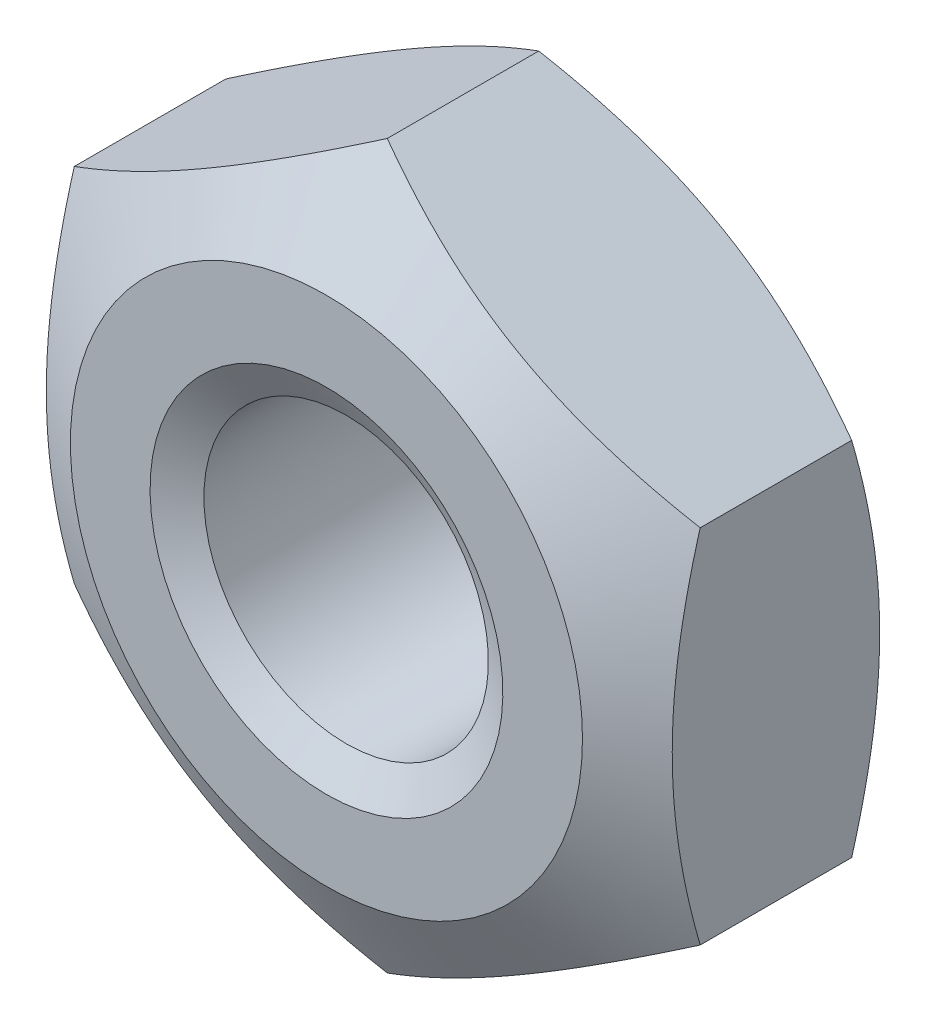
ISO-10303-21;
HEADER;
FILE_DESCRIPTION(('STEP AP214'),'2;1');
FILE_NAME('part.step','',(''),(''),'','','');
FILE_SCHEMA(('AUTOMOTIVE_DESIGN { 1 0 10303 214 1 1 1 1 }'));
ENDSEC;
DATA;
#1=APPLICATION_CONTEXT('core data for automotive mechanical design processes');
#2=APPLICATION_PROTOCOL_DEFINITION('international standard','automotive_design',2000,#1);
#3=PRODUCT_CONTEXT('',#1,'mechanical');
#4=PRODUCT('Part','Part','',(#3));
#5=PRODUCT_RELATED_PRODUCT_CATEGORY('part','',(#4));
#6=PRODUCT_DEFINITION_FORMATION('','',#4);
#7=PRODUCT_DEFINITION_CONTEXT('part definition',#1,'design');
#8=PRODUCT_DEFINITION('design','',#6,#7);
#9=PRODUCT_DEFINITION_SHAPE('','',#8);
#10=(LENGTH_UNIT() NAMED_UNIT(*) SI_UNIT(.MILLI.,.METRE.));
#11=(NAMED_UNIT(*) PLANE_ANGLE_UNIT() SI_UNIT($,.RADIAN.));
#12=(NAMED_UNIT(*) SI_UNIT($,.STERADIAN.) SOLID_ANGLE_UNIT());
#13=UNCERTAINTY_MEASURE_WITH_UNIT(LENGTH_MEASURE(1.E-05),#10,'distance_accuracy_value','');
#14=(GEOMETRIC_REPRESENTATION_CONTEXT(3) GLOBAL_UNCERTAINTY_ASSIGNED_CONTEXT((#13)) GLOBAL_UNIT_ASSIGNED_CONTEXT((#10,
#11,#12)) REPRESENTATION_CONTEXT('',''));
#15=CARTESIAN_POINT('',(0.,0.,0.));
#16=DIRECTION('',(0.,0.,1.));
#17=DIRECTION('',(1.,0.,0.));
#18=AXIS2_PLACEMENT_3D('',#15,#16,#17);
#19=CARTESIAN_POINT('',(0.,0.,0.));
#20=DIRECTION('',(0.,0.,1.));
#21=DIRECTION('',(1.,0.,0.));
#22=AXIS2_PLACEMENT_3D('',#19,#20,#21);
#23=PLANE('',#22);
#24=CARTESIAN_POINT('',(0.,0.,0.));
#25=DIRECTION('',(0.,0.,1.));
#26=DIRECTION('',(0.,-1.,0.));
#27=AXIS2_PLACEMENT_3D('',#24,#25,#26);
#28=CIRCLE('',#27,1.55);
#29=CARTESIAN_POINT('',(0.,-1.54999999999999,0.));
#30=VERTEX_POINT('',#29);
#31=EDGE_CURVE('E265',#30,#30,#28,.T.);
#32=ORIENTED_EDGE('',*,*,#31,.F.);
#33=EDGE_LOOP('',(#32));
#34=FACE_BOUND('',#33,.T.);
#35=CARTESIAN_POINT('',(0.,0.,0.));
#36=DIRECTION('',(0.,0.,1.));
#37=DIRECTION('',(1.,0.,0.));
#38=AXIS2_PLACEMENT_3D('',#35,#36,#37);
#39=CIRCLE('',#38,2.25);
#40=CARTESIAN_POINT('',(2.25,0.,0.));
#41=VERTEX_POINT('',#40);
#42=EDGE_CURVE('E224',#41,#41,#39,.T.);
#43=ORIENTED_EDGE('',*,*,#42,.T.);
#44=EDGE_LOOP('',(#43));
#45=FACE_BOUND('',#44,.T.);
#46=ADVANCED_FACE('F37',(#34,#45),#23,.T.);
#47=CARTESIAN_POINT('',(0.,0.,0.));
#48=DIRECTION('',(0.,0.,-1.));
#49=DIRECTION('',(-1.,0.,0.));
#50=AXIS2_PLACEMENT_3D('',#47,#48,#49);
#51=CONICAL_SURFACE('',#50,2.25,1.0471975511966);
#52=CARTESIAN_POINT('',(-2.75020000000001,1.58759777021761,-0.534361897959571));
#53=CARTESIAN_POINT('',(-2.6293507793401,1.65737010029696,-0.494062796844074));
#54=CARTESIAN_POINT('',(-2.50745839737738,1.72774469983531,-0.457412037192472));
#55=CARTESIAN_POINT('',(-2.26156287327212,1.86971254687,-0.39343731756461));
#56=CARTESIAN_POINT('',(-2.13755536142616,1.94130831721581,-0.366135990269306));
#57=CARTESIAN_POINT('',(-1.89107720202407,2.08361254889597,-0.323636879888924));
#58=CARTESIAN_POINT('',(-1.7686444814126,2.15429911309862,-0.308156253217264));
#59=CARTESIAN_POINT('',(-1.5232028576311,2.29600490065921,-0.289674531964746));
#60=CARTESIAN_POINT('',(-1.4001948467671,2.36702360884402,-0.286658134057405));
#61=CARTESIAN_POINT('',(-1.17034121338922,2.49972966594895,-0.292928280023351));
#62=CARTESIAN_POINT('',(-1.06346120874599,2.56143686540071,-0.300675288871507));
#63=CARTESIAN_POINT('',(-0.85039753266526,2.68444923614045,-0.325230315659159));
#64=CARTESIAN_POINT('',(-0.744214598351119,2.74575398185006,-0.342046724245375));
#65=CARTESIAN_POINT('',(-0.530711510606822,2.86902004703205,-0.384087056940762));
#66=CARTESIAN_POINT('',(-0.42341838385715,2.93096576264317,-0.409489215282037));
#67=CARTESIAN_POINT('',(-0.210432520715951,3.05393320806133,-0.467142360434789));
#68=CARTESIAN_POINT('',(-0.104737054973348,3.11495651365994,-0.49937979789379));
#69=CARTESIAN_POINT('',(0.000199999999999974,3.17554195059677,-0.534361897959569));
#70=B_SPLINE_CURVE_WITH_KNOTS('',3,(#52,#53,#54,#55,#56,#57,#58,#59,#60,#61,#62,#63,#64,#65,#66,
#67,#68,#69),.UNSPECIFIED.,.F.,.F.,(4,2,2,2,2,2,2,2,4),(0.,0.435912828725888,0.872873557116332,
1.29901931904671,1.72464171213573,2.09526089052938,2.46622354066375,2.84541551798559,
3.22386274754526),.UNSPECIFIED.);
#71=CARTESIAN_POINT('',(-2.75,1.58771324027145,-0.534295227656671));
#72=VERTEX_POINT('',#71);
#73=CARTESIAN_POINT('',(0.,3.17542648054293,-0.534295227656671));
#74=VERTEX_POINT('',#73);
#75=EDGE_CURVE('E219',#72,#74,#70,.T.);
#76=ORIENTED_EDGE('',*,*,#75,.F.);
#77=CARTESIAN_POINT('',(-2.74999999999998,-4.17094191172018,-1.58535995000983));
#78=CARTESIAN_POINT('',(-2.74999999999998,-4.05157417919455,-1.52783985485414));
#79=CARTESIAN_POINT('',(-2.74999999999999,-3.93192208680263,-1.47089921340537));
#80=CARTESIAN_POINT('',(-2.74999999999999,-3.69189754974667,-1.35850483223983));
#81=CARTESIAN_POINT('',(-2.74999999999999,-3.57152498585856,-1.30305134743429));
#82=CARTESIAN_POINT('',(-2.74999999999999,-3.3292414178549,-1.19365987345141));
#83=CARTESIAN_POINT('',(-2.74999999999999,-3.20732553286572,-1.1397326551652));
#84=CARTESIAN_POINT('',(-2.74999999999999,-2.96249043886675,-1.03421478265883));
#85=CARTESIAN_POINT('',(-2.74999999999999,-2.83957128062765,-0.982624011057358));
#86=CARTESIAN_POINT('',(-2.74999999999999,-2.58897064424779,-0.880953460848801));
#87=CARTESIAN_POINT('',(-2.74999999999999,-2.46125395597333,-0.830959972131938));
#88=CARTESIAN_POINT('',(-2.74999999999999,-2.20429217508488,-0.734989140643749));
#89=CARTESIAN_POINT('',(-2.74999999999999,-2.0750469081031,-0.689012261170476));
#90=CARTESIAN_POINT('',(-2.74999999999999,-1.81509622614656,-0.602350799198662));
#91=CARTESIAN_POINT('',(-2.75,-1.68439471248182,-0.561654637381358));
#92=CARTESIAN_POINT('',(-2.75,-1.42112044045795,-0.486921696520409));
#93=CARTESIAN_POINT('',(-2.75,-1.28854831568341,-0.452882718076814));
#94=CARTESIAN_POINT('',(-2.75,-1.02216222796121,-0.393330190707876));
#95=CARTESIAN_POINT('',(-2.75,-0.888357777462689,-0.367774900827353));
#96=CARTESIAN_POINT('',(-2.75,-0.619188443271271,-0.326700866431593));
#97=CARTESIAN_POINT('',(-2.75,-0.483823678897038,-0.311181359585503));
#98=CARTESIAN_POINT('',(-2.75,-0.213936143558709,-0.291620721702803));
#99=CARTESIAN_POINT('',(-2.75,-0.0794237789789004,-0.287439497799149));
#100=CARTESIAN_POINT('',(-2.75,0.189476875095198,-0.290546406339069));
#101=CARTESIAN_POINT('',(-2.75,0.323865159350496,-0.297835002730547));
#102=CARTESIAN_POINT('',(-2.75,0.554893379449256,-0.319724470777096));
#103=CARTESIAN_POINT('',(-2.75000000000001,0.651787779258228,-0.331774817011496));
#104=CARTESIAN_POINT('',(-2.75000000000001,0.844801886898879,-0.361034396057224));
#105=CARTESIAN_POINT('',(-2.75000000000001,0.940921474752412,-0.37824441265319));
#106=CARTESIAN_POINT('',(-2.75000000000001,1.22801374432727,-0.436704923279867));
#107=CARTESIAN_POINT('',(-2.75000000000001,1.41759987178668,-0.484773071382858));
#108=CARTESIAN_POINT('',(-2.75000000000001,1.79688918277039,-0.595144853922151));
#109=CARTESIAN_POINT('',(-2.75000000000001,1.98650596068932,-0.65773427101591));
#110=CARTESIAN_POINT('',(-2.75000000000001,2.26832259438815,-0.758664209554614));
#111=CARTESIAN_POINT('',(-2.75000000000001,2.36181446832384,-0.793476731430835));
#112=CARTESIAN_POINT('',(-2.75000000000001,2.54803932294426,-0.865075780032284));
#113=CARTESIAN_POINT('',(-2.75000000000001,2.6407723109558,-0.901862287673288));
#114=CARTESIAN_POINT('',(-2.75000000000002,2.85279068758439,-0.988151634401225));
#115=CARTESIAN_POINT('',(-2.75000000000002,2.97185009604171,-1.03820800297955));
#116=CARTESIAN_POINT('',(-2.75000000000002,3.20902736987715,-1.14050851197707));
#117=CARTESIAN_POINT('',(-2.75000000000002,3.32714519214704,-1.19275275188562));
#118=CARTESIAN_POINT('',(-2.75000000000002,3.68035595861855,-1.35211254525139));
#119=CARTESIAN_POINT('',(-2.75000000000002,3.9142692376034,-1.46183979317702));
#120=CARTESIAN_POINT('',(-2.75000000000002,4.38006837711245,-1.68598214563198));
#121=CARTESIAN_POINT('',(-2.75000000000002,4.61195228635671,-1.80040126470261));
#122=CARTESIAN_POINT('',(-2.75000000000002,5.07411991279684,-2.03243730193511));
#123=CARTESIAN_POINT('',(-2.75000000000003,5.30440357913535,-2.15005432115122));
#124=CARTESIAN_POINT('',(-2.75000000000003,5.74575965877126,-2.37825325657572));
#125=CARTESIAN_POINT('',(-2.75000000000003,5.9569214419775,-2.48866288043221));
#126=CARTESIAN_POINT('',(-2.75000000000003,6.37847605090656,-2.71095354359167));
#127=CARTESIAN_POINT('',(-2.75000000000003,6.5888688543058,-2.82283462518444));
#128=CARTESIAN_POINT('',(-2.75000000000003,7.00860016719332,-3.04748460058433));
#129=CARTESIAN_POINT('',(-2.75000000000003,7.21793996928446,-3.16025108273532));
#130=CARTESIAN_POINT('',(-2.75000000000004,7.63612432069422,-3.38667545638205));
#131=CARTESIAN_POINT('',(-2.75000000000004,7.84496889300508,-3.50033330539519));
#132=CARTESIAN_POINT('',(-2.75000000000004,8.05362923922143,-3.61432611594186));
#133=B_SPLINE_CURVE_WITH_KNOTS('',3,(#77,#78,#79,#80,#81,#82,#83,#84,#85,#86,#87,#88,#89,#90,
#91,#92,#93,#94,#95,#96,#97,#98,#99,#100,#101,#102,#103,#104,#105,#106,#107,#108,#109,#110,#111,
#112,#113,#114,#115,#116,#117,#118,#119,#120,#121,#122,#123,#124,#125,#126,#127,#128,#129,#130,
#131,#132),.UNSPECIFIED.,.F.,.F.,(4,2,2,2,2,2,2,2,2,2,2,2,2,2,2,2,2,2,2,2,2,2,2,2,2,2,2,4),(0.,
0.397516289629709,0.795100286958886,1.19501152551803,1.59490265050159,2.00630901998287,
2.41776278088078,2.8282985036957,3.23869836376216,3.64704799033318,4.05536659450197,
4.45861662670271,4.86188297056404,5.15466277742565,5.44748708183662,6.03349625442335,
6.63219807054858,6.93146946485046,7.23073796635865,7.61817202589461,8.00562372244204,
8.78064716960591,9.55634818940369,10.3320737500517,11.0469209777075,11.7617887952143,
12.4751271265047,13.1884316641826),.UNSPECIFIED.);
#134=CARTESIAN_POINT('',(-2.75,-1.58771324027146,-0.534295227656671));
#135=VERTEX_POINT('',#134);
#136=EDGE_CURVE('E187',#135,#72,#133,.T.);
#137=ORIENTED_EDGE('',*,*,#136,.F.);
#138=CARTESIAN_POINT('',(0.000200000000020716,-3.17554195059679,-0.534361897959577));
#139=CARTESIAN_POINT('',(-0.120649220659886,-3.10576962051743,-0.49406279684408));
#140=CARTESIAN_POINT('',(-0.242541602622614,-3.03539502097909,-0.457412037192478));
#141=CARTESIAN_POINT('',(-0.488437126727875,-2.89342717394439,-0.393437317564616));
#142=CARTESIAN_POINT('',(-0.612444638573838,-2.82183140359859,-0.366135990269313));
#143=CARTESIAN_POINT('',(-0.858922797975928,-2.67952717191843,-0.323636879888932));
#144=CARTESIAN_POINT('',(-0.981355518587402,-2.60884060771578,-0.308156253217272));
#145=CARTESIAN_POINT('',(-1.2267971423689,-2.4671348201552,-0.289674531964755));
#146=CARTESIAN_POINT('',(-1.3498051532329,-2.39611611197039,-0.286658134057414));
#147=CARTESIAN_POINT('',(-1.57965878661078,-2.26341005486546,-0.292928280023361));
#148=CARTESIAN_POINT('',(-1.68653879125401,-2.2017028554137,-0.300675288871517));
#149=CARTESIAN_POINT('',(-1.89960246733474,-2.07869048467396,-0.325230315659169));
#150=CARTESIAN_POINT('',(-2.00578540164888,-2.01738573896435,-0.342046724245385));
#151=CARTESIAN_POINT('',(-2.21928848939318,-1.89411967378236,-0.384087056940771));
#152=CARTESIAN_POINT('',(-2.32658161614285,-1.83217395817124,-0.409489215282046));
#153=CARTESIAN_POINT('',(-2.53956747928405,-1.70920651275309,-0.467142360434797));
#154=CARTESIAN_POINT('',(-2.64526294502665,-1.64818320715448,-0.499379797893798));
#155=CARTESIAN_POINT('',(-2.7502,-1.58759777021765,-0.534361897959576));
#156=B_SPLINE_CURVE_WITH_KNOTS('',3,(#138,#139,#140,#141,#142,#143,#144,#145,#146,#147,#148,
#149,#150,#151,#152,#153,#154,#155),.UNSPECIFIED.,.F.,.F.,(4,2,2,2,2,2,2,2,4),(0.,
0.43591282872589,0.872873557116335,1.29901931904672,1.72464171213574,2.09526089052938,
2.46622354066375,2.84541551798558,3.22386274754525),.UNSPECIFIED.);
#157=CARTESIAN_POINT('',(0.,-3.17542648054293,-0.534295227656671));
#158=VERTEX_POINT('',#157);
#159=EDGE_CURVE('E179',#158,#135,#156,.T.);
#160=ORIENTED_EDGE('',*,*,#159,.F.);
#161=CARTESIAN_POINT('',(2.7502,-1.58759777021763,-0.53436189795957));
#162=CARTESIAN_POINT('',(2.62935077934009,-1.65737010029698,-0.494062796844073));
#163=CARTESIAN_POINT('',(2.50745839737736,-1.72774469983533,-0.457412037192472));
#164=CARTESIAN_POINT('',(2.2615628732721,-1.86971254687003,-0.393437317564612));
#165=CARTESIAN_POINT('',(2.13755536142614,-1.94130831721583,-0.366135990269309));
#166=CARTESIAN_POINT('',(1.89107720202405,-2.08361254889599,-0.323636879888929));
#167=CARTESIAN_POINT('',(1.76864448141258,-2.15429911309864,-0.308156253217271));
#168=CARTESIAN_POINT('',(1.52320285763108,-2.29600490065923,-0.289674531964754));
#169=CARTESIAN_POINT('',(1.40019484676709,-2.36702360884404,-0.286658134057414));
#170=CARTESIAN_POINT('',(1.17034121338921,-2.49972966594898,-0.292928280023363));
#171=CARTESIAN_POINT('',(1.06346120874598,-2.56143686540073,-0.300675288871519));
#172=CARTESIAN_POINT('',(0.850397532665258,-2.68444923614047,-0.325230315659172));
#173=CARTESIAN_POINT('',(0.74421459835112,-2.74575398185008,-0.342046724245387));
#174=CARTESIAN_POINT('',(0.530711510606829,-2.86902004703207,-0.384087056940773));
#175=CARTESIAN_POINT('',(0.423418383857159,-2.93096576264319,-0.409489215282048));
#176=CARTESIAN_POINT('',(0.210432520715966,-3.05393320806134,-0.467142360434799));
#177=CARTESIAN_POINT('',(0.104737054973367,-3.11495651365996,-0.499379797893799));
#178=CARTESIAN_POINT('',(-0.000199999999979356,-3.17554195059679,-0.534361897959577));
#179=B_SPLINE_CURVE_WITH_KNOTS('',3,(#161,#162,#163,#164,#165,#166,#167,#168,#169,#170,#171,
#172,#173,#174,#175,#176,#177,#178),.UNSPECIFIED.,.F.,.F.,(4,2,2,2,2,2,2,2,4),(0.,
0.435912828725888,0.872873557116332,1.29901931904672,1.72464171213574,2.09526089052937,
2.46622354066373,2.84541551798556,3.22386274754523),.UNSPECIFIED.);
#180=CARTESIAN_POINT('',(2.74999999999999,-1.58771324027147,-0.534295227656671));
#181=VERTEX_POINT('',#180);
#182=EDGE_CURVE('E95',#181,#158,#179,.T.);
#183=ORIENTED_EDGE('',*,*,#182,.F.);
#184=CARTESIAN_POINT('',(2.75,-4.17094191172015,-1.58535995000982));
#185=CARTESIAN_POINT('',(2.75,-4.05157417919452,-1.52783985485413));
#186=CARTESIAN_POINT('',(2.75,-3.9319220868026,-1.47089921340535));
#187=CARTESIAN_POINT('',(2.75,-3.69189754974664,-1.35850483223982));
#188=CARTESIAN_POINT('',(2.75,-3.57152498585853,-1.30305134743428));
#189=CARTESIAN_POINT('',(2.75,-3.32924141785487,-1.1936598734514));
#190=CARTESIAN_POINT('',(2.75,-3.20732553286569,-1.13973265516519));
#191=CARTESIAN_POINT('',(2.75,-2.96249043886672,-1.03421478265882));
#192=CARTESIAN_POINT('',(2.75,-2.83957128062762,-0.982624011057348));
#193=CARTESIAN_POINT('',(2.75,-2.58897064424776,-0.880953460848792));
#194=CARTESIAN_POINT('',(2.75,-2.4612539559733,-0.830959972131929));
#195=CARTESIAN_POINT('',(2.75,-2.20429217508485,-0.734989140643741));
#196=CARTESIAN_POINT('',(2.75,-2.07504690810308,-0.689012261170468));
#197=CARTESIAN_POINT('',(2.75,-1.81509622614653,-0.602350799198655));
#198=CARTESIAN_POINT('',(2.75,-1.6843947124818,-0.56165463738135));
#199=CARTESIAN_POINT('',(2.75,-1.42112044045793,-0.486921696520402));
#200=CARTESIAN_POINT('',(2.75,-1.28854831568339,-0.452882718076808));
#201=CARTESIAN_POINT('',(2.75,-1.02216222796119,-0.393330190707871));
#202=CARTESIAN_POINT('',(2.75,-0.888357777462668,-0.367774900827347));
#203=CARTESIAN_POINT('',(2.75,-0.619188443271251,-0.326700866431588));
#204=CARTESIAN_POINT('',(2.75,-0.483823678897018,-0.311181359585498));
#205=CARTESIAN_POINT('',(2.75,-0.213936143558689,-0.291620721702799));
#206=CARTESIAN_POINT('',(2.75,-0.0794237789788813,-0.287439497799145));
#207=CARTESIAN_POINT('',(2.75,0.189476875095217,-0.290546406339066));
#208=CARTESIAN_POINT('',(2.75,0.323865159350514,-0.297835002730543));
#209=CARTESIAN_POINT('',(2.75,0.554893379449273,-0.319724470777093));
#210=CARTESIAN_POINT('',(2.75,0.651787779258245,-0.331774817011493));
#211=CARTESIAN_POINT('',(2.75,0.844801886898896,-0.361034396057221));
#212=CARTESIAN_POINT('',(2.75,0.940921474752429,-0.378244412653187));
#213=CARTESIAN_POINT('',(2.75,1.22801374432728,-0.436704923279864));
#214=CARTESIAN_POINT('',(2.75,1.4175998717867,-0.484773071382855));
#215=CARTESIAN_POINT('',(2.75,1.79688918277041,-0.595144853922149));
#216=CARTESIAN_POINT('',(2.75,1.98650596068934,-0.657734271015908));
#217=CARTESIAN_POINT('',(2.75,2.26832259438817,-0.758664209554612));
#218=CARTESIAN_POINT('',(2.75,2.36181446832386,-0.793476731430834));
#219=CARTESIAN_POINT('',(2.75,2.54803932294428,-0.865075780032283));
#220=CARTESIAN_POINT('',(2.75,2.64077231095581,-0.901862287673287));
#221=CARTESIAN_POINT('',(2.75,2.85279068758441,-0.988151634401225));
#222=CARTESIAN_POINT('',(2.75,2.97185009604173,-1.03820800297955));
#223=CARTESIAN_POINT('',(2.75,3.20902736987717,-1.14050851197707));
#224=CARTESIAN_POINT('',(2.75,3.32714519214706,-1.19275275188562));
#225=CARTESIAN_POINT('',(2.75,3.68035595861857,-1.35211254525139));
#226=CARTESIAN_POINT('',(2.75,3.91426923760343,-1.46183979317702));
#227=CARTESIAN_POINT('',(2.75,4.38006837711248,-1.68598214563198));
#228=CARTESIAN_POINT('',(2.75,4.61195228635674,-1.80040126470262));
#229=CARTESIAN_POINT('',(2.75,5.07411991279688,-2.03243730193512));
#230=CARTESIAN_POINT('',(2.75,5.30440357913539,-2.15005432115123));
#231=CARTESIAN_POINT('',(2.75,5.7457596587713,-2.37825325657574));
#232=CARTESIAN_POINT('',(2.75,5.95692144197755,-2.48866288043222));
#233=CARTESIAN_POINT('',(2.75,6.37847605090661,-2.71095354359168));
#234=CARTESIAN_POINT('',(2.75,6.58886885430584,-2.82283462518446));
#235=CARTESIAN_POINT('',(2.75,7.00860016719337,-3.04748460058435));
#236=CARTESIAN_POINT('',(2.75,7.21793996928451,-3.16025108273533));
#237=CARTESIAN_POINT('',(2.75,7.63612432069427,-3.38667545638207));
#238=CARTESIAN_POINT('',(2.75,7.84496889300514,-3.50033330539521));
#239=CARTESIAN_POINT('',(2.75,8.05362923922149,-3.61432611594188));
#240=B_SPLINE_CURVE_WITH_KNOTS('',3,(#184,#185,#186,#187,#188,#189,#190,#191,#192,#193,#194,
#195,#196,#197,#198,#199,#200,#201,#202,#203,#204,#205,#206,#207,#208,#209,#210,#211,#212,#213,
#214,#215,#216,#217,#218,#219,#220,#221,#222,#223,#224,#225,#226,#227,#228,#229,#230,#231,#232,
#233,#234,#235,#236,#237,#238,#239),.UNSPECIFIED.,.F.,.F.,(4,2,2,2,2,2,2,2,2,2,2,2,2,2,2,2,2,2,
2,2,2,2,2,2,2,2,2,4),(0.,0.397516289629708,0.795100286958884,1.19501152551802,1.59490265050159,
2.00630901998287,2.41776278088077,2.82829850369569,3.23869836376215,3.64704799033317,
4.05536659450196,4.4586166267027,4.86188297056402,5.15466277742563,5.4474870818366,
6.03349625442333,6.63219807054856,6.93146946485044,7.23073796635863,7.6181720258946,
8.00562372244203,8.78064716960591,9.55634818940369,10.3320737500517,11.0469209777075,
11.7617887952143,12.4751271265048,13.1884316641826),.UNSPECIFIED.);
#241=CARTESIAN_POINT('',(2.75,1.58771324027146,-0.534295227656671));
#242=VERTEX_POINT('',#241);
#243=EDGE_CURVE('E91',#242,#181,#240,.F.);
#244=ORIENTED_EDGE('',*,*,#243,.F.);
#245=CARTESIAN_POINT('',(-0.0002,3.17554195059677,-0.534361897959569));
#246=CARTESIAN_POINT('',(0.120649220659906,3.10576962051742,-0.494062796844072));
#247=CARTESIAN_POINT('',(0.242541602622634,3.03539502097908,-0.457412037192472));
#248=CARTESIAN_POINT('',(0.488437126727894,2.89342717394438,-0.393437317564611));
#249=CARTESIAN_POINT('',(0.612444638573858,2.82183140359858,-0.366135990269308));
#250=CARTESIAN_POINT('',(0.858922797975947,2.67952717191842,-0.323636879888929));
#251=CARTESIAN_POINT('',(0.981355518587421,2.60884060771577,-0.308156253217271));
#252=CARTESIAN_POINT('',(1.22679714236892,2.46713482015519,-0.289674531964755));
#253=CARTESIAN_POINT('',(1.34980515323292,2.39611611197038,-0.286658134057415));
#254=CARTESIAN_POINT('',(1.5796587866108,2.26341005486545,-0.292928280023363));
#255=CARTESIAN_POINT('',(1.68653879125403,2.20170285541369,-0.300675288871519));
#256=CARTESIAN_POINT('',(1.89960246733475,2.07869048467396,-0.325230315659172));
#257=CARTESIAN_POINT('',(2.00578540164889,2.01738573896435,-0.342046724245388));
#258=CARTESIAN_POINT('',(2.21928848939318,1.89411967378237,-0.384087056940775));
#259=CARTESIAN_POINT('',(2.32658161614285,1.83217395817125,-0.409489215282049));
#260=CARTESIAN_POINT('',(2.53956747928405,1.7092065127531,-0.4671423604348));
#261=CARTESIAN_POINT('',(2.64526294502665,1.64818320715448,-0.4993797978938));
#262=CARTESIAN_POINT('',(2.7502,1.58759777021766,-0.534361897959578));
#263=B_SPLINE_CURVE_WITH_KNOTS('',3,(#245,#246,#247,#248,#249,#250,#251,#252,#253,#254,#255,
#256,#257,#258,#259,#260,#261,#262),.UNSPECIFIED.,.F.,.F.,(4,2,2,2,2,2,2,2,4),(0.,
0.435912828725888,0.872873557116331,1.29901931904671,1.72464171213573,2.09526089052937,
2.46622354066373,2.84541551798556,3.22386274754522),.UNSPECIFIED.);
#264=EDGE_CURVE('E63',#74,#242,#263,.T.);
#265=ORIENTED_EDGE('',*,*,#264,.F.);
#266=EDGE_LOOP('',(#76,#137,#160,#183,#244,#265));
#267=FACE_BOUND('',#266,.T.);
#268=ORIENTED_EDGE('',*,*,#42,.F.);
#269=EDGE_LOOP('',(#268));
#270=FACE_BOUND('',#269,.T.);
#271=ADVANCED_FACE('F92',(#267,#270),#51,.T.);
#272=CARTESIAN_POINT('',(2.75,1.58771324027149,-2.4));
#273=DIRECTION('',(0.499999999999993,0.866025403784443,0.));
#274=DIRECTION('',(-0.866025403784443,0.499999999999993,0.));
#275=AXIS2_PLACEMENT_3D('',#272,#273,#274);
#276=PLANE('',#275);
#277=DIRECTION('',(0.,0.,1.));
#278=VECTOR('',#277,1.);
#279=CARTESIAN_POINT('',(2.75,1.58771324027149,-2.4));
#280=LINE('',#279,#278);
#281=CARTESIAN_POINT('',(2.75,1.58771324027146,-1.86570477234333));
#282=VERTEX_POINT('',#281);
#283=EDGE_CURVE('E11',#282,#242,#280,.T.);
#284=ORIENTED_EDGE('',*,*,#283,.F.);
#285=CARTESIAN_POINT('',(2.7502,1.58759777021766,-1.86563810204042));
#286=CARTESIAN_POINT('',(2.62935077934009,1.65737010029701,-1.90593720315592));
#287=CARTESIAN_POINT('',(2.50745839737736,1.72774469983535,-1.94258796280752));
#288=CARTESIAN_POINT('',(2.2615628732721,1.86971254687005,-2.00656268243538));
#289=CARTESIAN_POINT('',(2.13755536142614,1.94130831721585,-2.03386400973069));
#290=CARTESIAN_POINT('',(1.89107720202405,2.08361254889601,-2.07636312011107));
#291=CARTESIAN_POINT('',(1.76864448141257,2.15429911309866,-2.09184374678273));
#292=CARTESIAN_POINT('',(1.52320285763107,2.29600490065924,-2.11032546803524));
#293=CARTESIAN_POINT('',(1.40019484676707,2.36702360884405,-2.11334186594259));
#294=CARTESIAN_POINT('',(1.17034121338919,2.49972966594898,-2.10707171997664));
#295=CARTESIAN_POINT('',(1.06346120874597,2.56143686540074,-2.09932471112848));
#296=CARTESIAN_POINT('',(0.85039753266524,2.68444923614047,-2.07476968434083));
#297=CARTESIAN_POINT('',(0.744214598351102,2.74575398185008,-2.05795327575462));
#298=CARTESIAN_POINT('',(0.53071151060681,2.86902004703206,-2.01591294305923));
#299=CARTESIAN_POINT('',(0.42341838385714,2.93096576264318,-1.99051078471796));
#300=CARTESIAN_POINT('',(0.210432520715947,3.05393320806133,-1.93285763956521));
#301=CARTESIAN_POINT('',(0.104737054973347,3.11495651365995,-1.90062020210621));
#302=CARTESIAN_POINT('',(-0.000199999999999647,3.17554195059677,-1.86563810204043));
#303=B_SPLINE_CURVE_WITH_KNOTS('',3,(#285,#286,#287,#288,#289,#290,#291,#292,#293,#294,#295,
#296,#297,#298,#299,#300,#301,#302),.UNSPECIFIED.,.F.,.F.,(4,2,2,2,2,2,2,2,4),(0.,
0.435912828725889,0.872873557116334,1.29901931904672,1.72464171213574,2.09526089052937,
2.46622354066374,2.84541551798556,3.22386274754522),.UNSPECIFIED.);
#304=CARTESIAN_POINT('',(0.,3.17542648054293,-1.86570477234333));
#305=VERTEX_POINT('',#304);
#306=EDGE_CURVE('E111',#282,#305,#303,.T.);
#307=ORIENTED_EDGE('',*,*,#306,.T.);
#308=DIRECTION('',(0.,0.,1.));
#309=VECTOR('',#308,1.);
#310=CARTESIAN_POINT('',(0.,3.17542648054293,-2.4));
#311=LINE('',#310,#309);
#312=EDGE_CURVE('E42',#305,#74,#311,.T.);
#313=ORIENTED_EDGE('',*,*,#312,.T.);
#314=ORIENTED_EDGE('',*,*,#264,.T.);
#315=EDGE_LOOP('',(#284,#307,#313,#314));
#316=FACE_BOUND('',#315,.T.);
#317=ADVANCED_FACE('F39',(#316),#276,.T.);
#318=CARTESIAN_POINT('',(2.75,-1.58771324027147,-2.4));
#319=DIRECTION('',(1.,0.,0.));
#320=DIRECTION('',(0.,0.,-1.));
#321=AXIS2_PLACEMENT_3D('',#318,#319,#320);
#322=PLANE('',#321);
#323=DIRECTION('',(0.,0.,1.));
#324=VECTOR('',#323,1.);
#325=CARTESIAN_POINT('',(2.75,-1.58771324027147,-2.4));
#326=LINE('',#325,#324);
#327=CARTESIAN_POINT('',(2.74999999999999,-1.58771324027147,-1.86570477234333));
#328=VERTEX_POINT('',#327);
#329=EDGE_CURVE('E47',#328,#181,#326,.T.);
#330=ORIENTED_EDGE('',*,*,#329,.F.);
#331=CARTESIAN_POINT('',(2.75,-4.17094191172015,-0.814640049990189));
#332=CARTESIAN_POINT('',(2.75,-4.05157417919452,-0.872160145145874));
#333=CARTESIAN_POINT('',(2.75,-3.9319220868026,-0.929100786594652));
#334=CARTESIAN_POINT('',(2.75,-3.69189754974664,-1.04149516776018));
#335=CARTESIAN_POINT('',(2.75,-3.57152498585853,-1.09694865256572));
#336=CARTESIAN_POINT('',(2.75,-3.32924141785487,-1.2063401265486));
#337=CARTESIAN_POINT('',(2.75,-3.20732553286569,-1.26026734483481));
#338=CARTESIAN_POINT('',(2.75,-2.96249043886672,-1.36578521734119));
#339=CARTESIAN_POINT('',(2.75,-2.83957128062762,-1.41737598894266));
#340=CARTESIAN_POINT('',(2.75,-2.58897064424776,-1.51904653915121));
#341=CARTESIAN_POINT('',(2.75,-2.4612539559733,-1.56904002786807));
#342=CARTESIAN_POINT('',(2.75,-2.20429217508485,-1.66501085935626));
#343=CARTESIAN_POINT('',(2.75,-2.07504690810308,-1.71098773882953));
#344=CARTESIAN_POINT('',(2.75,-1.81509622614653,-1.79764920080135));
#345=CARTESIAN_POINT('',(2.75,-1.6843947124818,-1.83834536261865));
#346=CARTESIAN_POINT('',(2.75,-1.42112044045793,-1.9130783034796));
#347=CARTESIAN_POINT('',(2.75,-1.28854831568339,-1.94711728192319));
#348=CARTESIAN_POINT('',(2.75,-1.02216222796118,-2.00666980929213));
#349=CARTESIAN_POINT('',(2.75,-0.888357777462668,-2.03222509917265));
#350=CARTESIAN_POINT('',(2.75,-0.619188443271251,-2.07329913356841));
#351=CARTESIAN_POINT('',(2.75,-0.483823678897018,-2.0888186404145));
#352=CARTESIAN_POINT('',(2.75,-0.21393614355869,-2.1083792782972));
#353=CARTESIAN_POINT('',(2.75,-0.0794237789788815,-2.11256050220086));
#354=CARTESIAN_POINT('',(2.75,0.189476875095216,-2.10945359366093));
#355=CARTESIAN_POINT('',(2.75,0.323865159350513,-2.10216499726946));
#356=CARTESIAN_POINT('',(2.75,0.554893379449272,-2.08027552922291));
#357=CARTESIAN_POINT('',(2.75,0.651787779258244,-2.06822518298851));
#358=CARTESIAN_POINT('',(2.75,0.844801886898897,-2.03896560394278));
#359=CARTESIAN_POINT('',(2.75,0.94092147475243,-2.02175558734681));
#360=CARTESIAN_POINT('',(2.75,1.22801374432729,-1.96329507672014));
#361=CARTESIAN_POINT('',(2.75,1.41759987178671,-1.91522692861715));
#362=CARTESIAN_POINT('',(2.75,1.79688918277042,-1.80485514607785));
#363=CARTESIAN_POINT('',(2.75,1.98650596068935,-1.74226572898409));
#364=CARTESIAN_POINT('',(2.75,2.26832259438818,-1.64133579044539));
#365=CARTESIAN_POINT('',(2.75,2.36181446832387,-1.60652326856917));
#366=CARTESIAN_POINT('',(2.75,2.54803932294429,-1.53492421996772));
#367=CARTESIAN_POINT('',(2.75,2.64077231095583,-1.49813771232671));
#368=CARTESIAN_POINT('',(2.75,2.85279068758442,-1.41184836559877));
#369=CARTESIAN_POINT('',(2.75,2.97185009604174,-1.36179199702045));
#370=CARTESIAN_POINT('',(2.75,3.20902736987719,-1.25949148802293));
#371=CARTESIAN_POINT('',(2.75,3.32714519214708,-1.20724724811438));
#372=CARTESIAN_POINT('',(2.75,3.68035595861859,-1.04788745474861));
#373=CARTESIAN_POINT('',(2.75,3.91426923760344,-0.938160206822976));
#374=CARTESIAN_POINT('',(2.75,4.38006837711249,-0.714017854368019));
#375=CARTESIAN_POINT('',(2.75,4.61195228635675,-0.599598735297385));
#376=CARTESIAN_POINT('',(2.75,5.07411991279689,-0.36756269806488));
#377=CARTESIAN_POINT('',(2.75,5.3044035791354,-0.249945678848773));
#378=CARTESIAN_POINT('',(2.75,5.74575965877131,-0.0217467434242689));
#379=CARTESIAN_POINT('',(2.75,5.95692144197756,0.0886628804322174));
#380=CARTESIAN_POINT('',(2.75,6.37847605090662,0.310953543591677));
#381=CARTESIAN_POINT('',(2.75,6.58886885430586,0.42283462518445));
#382=CARTESIAN_POINT('',(2.75,7.00860016719338,0.647484600584343));
#383=CARTESIAN_POINT('',(2.75,7.21793996928452,0.760251082735328));
#384=CARTESIAN_POINT('',(2.75,7.63612432069429,0.986675456382062));
#385=CARTESIAN_POINT('',(2.75,7.84496889300515,1.1003333053952));
#386=CARTESIAN_POINT('',(2.75,8.0536292392215,1.21432611594187));
#387=B_SPLINE_CURVE_WITH_KNOTS('',3,(#331,#332,#333,#334,#335,#336,#337,#338,#339,#340,#341,
#342,#343,#344,#345,#346,#347,#348,#349,#350,#351,#352,#353,#354,#355,#356,#357,#358,#359,#360,
#361,#362,#363,#364,#365,#366,#367,#368,#369,#370,#371,#372,#373,#374,#375,#376,#377,#378,#379,
#380,#381,#382,#383,#384,#385,#386),.UNSPECIFIED.,.F.,.F.,(4,2,2,2,2,2,2,2,2,2,2,2,2,2,2,2,2,2,
2,2,2,2,2,2,2,2,2,4),(0.,0.397516289629709,0.795100286958884,1.19501152551802,1.59490265050159,
2.00630901998287,2.41776278088077,2.82829850369569,3.23869836376215,3.64704799033317,
4.05536659450196,4.4586166267027,4.86188297056402,5.15466277742563,5.44748708183661,
6.03349625442334,6.63219807054857,6.93146946485045,7.23073796635864,7.61817202589461,
8.00562372244204,8.78064716960592,9.5563481894037,10.3320737500517,11.0469209777075,
11.7617887952144,12.4751271265048,13.1884316641826),.UNSPECIFIED.);
#388=EDGE_CURVE('E109',#328,#282,#387,.T.);
#389=ORIENTED_EDGE('',*,*,#388,.T.);
#390=ORIENTED_EDGE('',*,*,#283,.T.);
#391=ORIENTED_EDGE('',*,*,#243,.T.);
#392=EDGE_LOOP('',(#330,#389,#390,#391));
#393=FACE_BOUND('',#392,.T.);
#394=ADVANCED_FACE('F108',(#393),#322,.T.);
#395=CARTESIAN_POINT('',(0.,-3.17542648054295,-2.4));
#396=DIRECTION('',(0.500000000000006,-0.866025403784435,0.));
#397=DIRECTION('',(0.866025403784435,0.500000000000006,0.));
#398=AXIS2_PLACEMENT_3D('',#395,#396,#397);
#399=PLANE('',#398);
#400=DIRECTION('',(0.,0.,1.));
#401=VECTOR('',#400,1.);
#402=CARTESIAN_POINT('',(0.,-3.17542648054295,-2.4));
#403=LINE('',#402,#401);
#404=CARTESIAN_POINT('',(0.,-3.17542648054293,-1.86570477234333));
#405=VERTEX_POINT('',#404);
#406=EDGE_CURVE('E208',#405,#158,#403,.T.);
#407=ORIENTED_EDGE('',*,*,#406,.F.);
#408=CARTESIAN_POINT('',(-0.000199999999979462,-3.17554195059679,-1.86563810204042));
#409=CARTESIAN_POINT('',(0.120649220659926,-3.10576962051743,-1.90593720315592));
#410=CARTESIAN_POINT('',(0.242541602622654,-3.03539502097908,-1.94258796280752));
#411=CARTESIAN_POINT('',(0.488437126727912,-2.89342717394439,-2.00656268243538));
#412=CARTESIAN_POINT('',(0.612444638573875,-2.82183140359858,-2.03386400973069));
#413=CARTESIAN_POINT('',(0.858922797975963,-2.67952717191842,-2.07636312011107));
#414=CARTESIAN_POINT('',(0.981355518587436,-2.60884060771577,-2.09184374678273));
#415=CARTESIAN_POINT('',(1.22679714236893,-2.46713482015518,-2.11032546803525));
#416=CARTESIAN_POINT('',(1.34980515323293,-2.39611611197037,-2.11334186594259));
#417=CARTESIAN_POINT('',(1.57965878661081,-2.26341005486544,-2.10707171997664));
#418=CARTESIAN_POINT('',(1.68653879125404,-2.20170285541368,-2.09932471112848));
#419=CARTESIAN_POINT('',(1.89960246733476,-2.07869048467394,-2.07476968434083));
#420=CARTESIAN_POINT('',(2.0057854016489,-2.01738573896433,-2.05795327575462));
#421=CARTESIAN_POINT('',(2.21928848939319,-1.89411967378234,-2.01591294305923));
#422=CARTESIAN_POINT('',(2.32658161614286,-1.83217395817123,-1.99051078471796));
#423=CARTESIAN_POINT('',(2.53956747928405,-1.70920651275307,-1.93285763956521));
#424=CARTESIAN_POINT('',(2.64526294502665,-1.64818320715446,-1.90062020210621));
#425=CARTESIAN_POINT('',(2.7502,-1.58759777021763,-1.86563810204043));
#426=B_SPLINE_CURVE_WITH_KNOTS('',3,(#408,#409,#410,#411,#412,#413,#414,#415,#416,#417,#418,
#419,#420,#421,#422,#423,#424,#425),.UNSPECIFIED.,.F.,.F.,(4,2,2,2,2,2,2,2,4),(0.,
0.435912828725889,0.872873557116334,1.29901931904672,1.72464171213574,2.09526089052937,
2.46622354066374,2.84541551798556,3.22386274754523),.UNSPECIFIED.);
#427=EDGE_CURVE('E112',#405,#328,#426,.T.);
#428=ORIENTED_EDGE('',*,*,#427,.T.);
#429=ORIENTED_EDGE('',*,*,#329,.T.);
#430=ORIENTED_EDGE('',*,*,#182,.T.);
#431=EDGE_LOOP('',(#407,#428,#429,#430));
#432=FACE_BOUND('',#431,.T.);
#433=ADVANCED_FACE('F173',(#432),#399,.T.);
#434=CARTESIAN_POINT('',(-2.75,-1.58771324027149,-2.4));
#435=DIRECTION('',(-0.499999999999995,-0.866025403784441,0.));
#436=DIRECTION('',(0.866025403784441,-0.499999999999995,0.));
#437=AXIS2_PLACEMENT_3D('',#434,#435,#436);
#438=PLANE('',#437);
#439=DIRECTION('',(0.,0.,1.));
#440=VECTOR('',#439,1.);
#441=CARTESIAN_POINT('',(-2.75,-1.58771324027149,-2.4));
#442=LINE('',#441,#440);
#443=CARTESIAN_POINT('',(-2.75,-1.58771324027146,-1.86570477234333));
#444=VERTEX_POINT('',#443);
#445=EDGE_CURVE('E211',#444,#135,#442,.T.);
#446=ORIENTED_EDGE('',*,*,#445,.F.);
#447=CARTESIAN_POINT('',(-2.7502,-1.58759777021765,-1.86563810204043));
#448=CARTESIAN_POINT('',(-2.62935077934009,-1.657370100297,-1.90593720315592));
#449=CARTESIAN_POINT('',(-2.50745839737736,-1.72774469983535,-1.94258796280752));
#450=CARTESIAN_POINT('',(-2.2615628732721,-1.86971254687004,-2.00656268243539));
#451=CARTESIAN_POINT('',(-2.13755536142614,-1.94130831721584,-2.03386400973069));
#452=CARTESIAN_POINT('',(-1.89107720202405,-2.083612548896,-2.07636312011107));
#453=CARTESIAN_POINT('',(-1.76864448141257,-2.15429911309865,-2.09184374678273));
#454=CARTESIAN_POINT('',(-1.52320285763107,-2.29600490065924,-2.11032546803525));
#455=CARTESIAN_POINT('',(-1.40019484676708,-2.36702360884405,-2.11334186594259));
#456=CARTESIAN_POINT('',(-1.17034121338919,-2.49972966594898,-2.10707171997664));
#457=CARTESIAN_POINT('',(-1.06346120874597,-2.56143686540074,-2.09932471112848));
#458=CARTESIAN_POINT('',(-0.850397532665236,-2.68444923614048,-2.07476968434083));
#459=CARTESIAN_POINT('',(-0.744214598351095,-2.74575398185009,-2.05795327575462));
#460=CARTESIAN_POINT('',(-0.530711510606799,-2.86902004703207,-2.01591294305923));
#461=CARTESIAN_POINT('',(-0.423418383857127,-2.93096576264319,-1.99051078471796));
#462=CARTESIAN_POINT('',(-0.210432520715929,-3.05393320806134,-1.9328576395652));
#463=CARTESIAN_POINT('',(-0.104737054973327,-3.11495651365996,-1.9006202021062));
#464=CARTESIAN_POINT('',(0.000200000000020994,-3.17554195059679,-1.86563810204042));
#465=B_SPLINE_CURVE_WITH_KNOTS('',3,(#447,#448,#449,#450,#451,#452,#453,#454,#455,#456,#457,
#458,#459,#460,#461,#462,#463,#464),.UNSPECIFIED.,.F.,.F.,(4,2,2,2,2,2,2,2,4),(0.,
0.435912828725889,0.872873557116334,1.29901931904672,1.72464171213574,2.09526089052938,
2.46622354066375,2.84541551798558,3.22386274754525),.UNSPECIFIED.);
#466=EDGE_CURVE('E115',#444,#405,#465,.T.);
#467=ORIENTED_EDGE('',*,*,#466,.T.);
#468=ORIENTED_EDGE('',*,*,#406,.T.);
#469=ORIENTED_EDGE('',*,*,#159,.T.);
#470=EDGE_LOOP('',(#446,#467,#468,#469));
#471=FACE_BOUND('',#470,.T.);
#472=ADVANCED_FACE('F169',(#471),#438,.T.);
#473=CARTESIAN_POINT('',(-2.75000000000001,1.58771324027145,-2.4));
#474=DIRECTION('',(-1.,0.,0.));
#475=DIRECTION('',(0.,-1.,0.));
#476=AXIS2_PLACEMENT_3D('',#473,#474,#475);
#477=PLANE('',#476);
#478=DIRECTION('',(0.,0.,1.));
#479=VECTOR('',#478,1.);
#480=CARTESIAN_POINT('',(-2.75000000000001,1.58771324027145,-2.4));
#481=LINE('',#480,#479);
#482=CARTESIAN_POINT('',(-2.75000000000001,1.58771324027145,-1.86570477234333));
#483=VERTEX_POINT('',#482);
#484=EDGE_CURVE('E214',#483,#72,#481,.T.);
#485=ORIENTED_EDGE('',*,*,#484,.F.);
#486=CARTESIAN_POINT('',(-2.74999999999998,-4.17094191172018,-0.814640049990177));
#487=CARTESIAN_POINT('',(-2.74999999999998,-4.05157417919455,-0.872160145145862));
#488=CARTESIAN_POINT('',(-2.74999999999999,-3.93192208680263,-0.92910078659464));
#489=CARTESIAN_POINT('',(-2.74999999999999,-3.69189754974667,-1.04149516776017));
#490=CARTESIAN_POINT('',(-2.74999999999999,-3.57152498585856,-1.09694865256571));
#491=CARTESIAN_POINT('',(-2.74999999999999,-3.32924141785491,-1.20634012654859));
#492=CARTESIAN_POINT('',(-2.74999999999999,-3.20732553286572,-1.2602673448348));
#493=CARTESIAN_POINT('',(-2.74999999999999,-2.96249043886675,-1.36578521734118));
#494=CARTESIAN_POINT('',(-2.74999999999999,-2.83957128062765,-1.41737598894265));
#495=CARTESIAN_POINT('',(-2.74999999999999,-2.58897064424779,-1.5190465391512));
#496=CARTESIAN_POINT('',(-2.74999999999999,-2.46125395597333,-1.56904002786807));
#497=CARTESIAN_POINT('',(-2.74999999999999,-2.20429217508488,-1.66501085935625));
#498=CARTESIAN_POINT('',(-2.74999999999999,-2.0750469081031,-1.71098773882953));
#499=CARTESIAN_POINT('',(-2.74999999999999,-1.81509622614656,-1.79764920080134));
#500=CARTESIAN_POINT('',(-2.75,-1.68439471248182,-1.83834536261864));
#501=CARTESIAN_POINT('',(-2.75,-1.42112044045795,-1.91307830347959));
#502=CARTESIAN_POINT('',(-2.75,-1.28854831568341,-1.94711728192319));
#503=CARTESIAN_POINT('',(-2.75,-1.02216222796121,-2.00666980929212));
#504=CARTESIAN_POINT('',(-2.75,-0.88835777746269,-2.03222509917265));
#505=CARTESIAN_POINT('',(-2.75,-0.619188443271271,-2.07329913356841));
#506=CARTESIAN_POINT('',(-2.75,-0.483823678897038,-2.0888186404145));
#507=CARTESIAN_POINT('',(-2.75,-0.213936143558709,-2.1083792782972));
#508=CARTESIAN_POINT('',(-2.75,-0.0794237789789007,-2.11256050220085));
#509=CARTESIAN_POINT('',(-2.75,0.189476875095198,-2.10945359366093));
#510=CARTESIAN_POINT('',(-2.75,0.323865159350495,-2.10216499726945));
#511=CARTESIAN_POINT('',(-2.75,0.554893379449255,-2.0802755292229));
#512=CARTESIAN_POINT('',(-2.75000000000001,0.651787779258228,-2.0682251829885));
#513=CARTESIAN_POINT('',(-2.75000000000001,0.84480188689888,-2.03896560394278));
#514=CARTESIAN_POINT('',(-2.75000000000001,0.940921474752414,-2.02175558734681));
#515=CARTESIAN_POINT('',(-2.75000000000001,1.22801374432727,-1.96329507672013));
#516=CARTESIAN_POINT('',(-2.75000000000001,1.41759987178669,-1.91522692861714));
#517=CARTESIAN_POINT('',(-2.75000000000001,1.7968891827704,-1.80485514607785));
#518=CARTESIAN_POINT('',(-2.75000000000001,1.98650596068933,-1.74226572898409));
#519=CARTESIAN_POINT('',(-2.75000000000001,2.26832259438816,-1.64133579044539));
#520=CARTESIAN_POINT('',(-2.75000000000001,2.36181446832385,-1.60652326856916));
#521=CARTESIAN_POINT('',(-2.75000000000001,2.54803932294427,-1.53492421996771));
#522=CARTESIAN_POINT('',(-2.75000000000001,2.64077231095581,-1.49813771232671));
#523=CARTESIAN_POINT('',(-2.75000000000002,2.8527906875844,-1.41184836559877));
#524=CARTESIAN_POINT('',(-2.75000000000002,2.97185009604172,-1.36179199702045));
#525=CARTESIAN_POINT('',(-2.75000000000002,3.20902736987716,-1.25949148802293));
#526=CARTESIAN_POINT('',(-2.75000000000002,3.32714519214705,-1.20724724811438));
#527=CARTESIAN_POINT('',(-2.75000000000002,3.68035595861856,-1.04788745474861));
#528=CARTESIAN_POINT('',(-2.75000000000002,3.91426923760341,-0.938160206822982));
#529=CARTESIAN_POINT('',(-2.75000000000002,4.38006837711246,-0.714017854368027));
#530=CARTESIAN_POINT('',(-2.75000000000002,4.61195228635672,-0.599598735297394));
#531=CARTESIAN_POINT('',(-2.75000000000002,5.07411991279686,-0.367562698064892));
#532=CARTESIAN_POINT('',(-2.75000000000003,5.30440357913536,-0.249945678848786));
#533=CARTESIAN_POINT('',(-2.75000000000003,5.74575965877127,-0.0217467434242833));
#534=CARTESIAN_POINT('',(-2.75000000000003,5.95692144197752,0.0886628804322022));
#535=CARTESIAN_POINT('',(-2.75000000000003,6.37847605090657,0.31095354359166));
#536=CARTESIAN_POINT('',(-2.75000000000003,6.58886885430581,0.422834625184432));
#537=CARTESIAN_POINT('',(-2.75000000000003,7.00860016719333,0.647484600584323));
#538=CARTESIAN_POINT('',(-2.75000000000003,7.21793996928447,0.760251082735307));
#539=CARTESIAN_POINT('',(-2.75000000000004,7.63612432069423,0.986675456382039));
#540=CARTESIAN_POINT('',(-2.75000000000004,7.84496889300509,1.10033330539518));
#541=CARTESIAN_POINT('',(-2.75000000000004,8.05362923922144,1.21432611594185));
#542=B_SPLINE_CURVE_WITH_KNOTS('',3,(#486,#487,#488,#489,#490,#491,#492,#493,#494,#495,#496,
#497,#498,#499,#500,#501,#502,#503,#504,#505,#506,#507,#508,#509,#510,#511,#512,#513,#514,#515,
#516,#517,#518,#519,#520,#521,#522,#523,#524,#525,#526,#527,#528,#529,#530,#531,#532,#533,#534,
#535,#536,#537,#538,#539,#540,#541),.UNSPECIFIED.,.F.,.F.,(4,2,2,2,2,2,2,2,2,2,2,2,2,2,2,2,2,2,
2,2,2,2,2,2,2,2,2,4),(0.,0.397516289629709,0.795100286958885,1.19501152551802,1.59490265050159,
2.00630901998287,2.41776278088078,2.8282985036957,3.23869836376216,3.64704799033318,
4.05536659450197,4.45861662670271,4.86188297056404,5.15466277742565,5.44748708183662,
6.03349625442335,6.63219807054859,6.93146946485046,7.23073796635866,7.61817202589462,
8.00562372244205,8.78064716960592,9.55634818940369,10.3320737500517,11.0469209777075,
11.7617887952143,12.4751271265047,13.1884316641826),.UNSPECIFIED.);
#543=EDGE_CURVE('E55',#483,#444,#542,.F.);
#544=ORIENTED_EDGE('',*,*,#543,.T.);
#545=ORIENTED_EDGE('',*,*,#445,.T.);
#546=ORIENTED_EDGE('',*,*,#136,.T.);
#547=EDGE_LOOP('',(#485,#544,#545,#546));
#548=FACE_BOUND('',#547,.T.);
#549=ADVANCED_FACE('F172',(#548),#477,.T.);
#550=CARTESIAN_POINT('',(0.,3.17542648054293,-2.4));
#551=DIRECTION('',(-0.500000000000003,0.866025403784437,0.));
#552=DIRECTION('',(-0.866025403784437,-0.500000000000003,0.));
#553=AXIS2_PLACEMENT_3D('',#550,#551,#552);
#554=PLANE('',#553);
#555=ORIENTED_EDGE('',*,*,#312,.F.);
#556=CARTESIAN_POINT('',(0.000200000000000057,3.17554195059677,-1.86563810204043));
#557=CARTESIAN_POINT('',(-0.120649220659906,3.10576962051742,-1.90593720315593));
#558=CARTESIAN_POINT('',(-0.242541602622633,3.03539502097907,-1.94258796280753));
#559=CARTESIAN_POINT('',(-0.488437126727891,2.89342717394438,-2.00656268243539));
#560=CARTESIAN_POINT('',(-0.612444638573853,2.82183140359857,-2.0338640097307));
#561=CARTESIAN_POINT('',(-0.85892279797594,2.67952717191841,-2.07636312011108));
#562=CARTESIAN_POINT('',(-0.981355518587413,2.60884060771576,-2.09184374678274));
#563=CARTESIAN_POINT('',(-1.22679714236891,2.46713482015518,-2.11032546803526));
#564=CARTESIAN_POINT('',(-1.34980515323291,2.39611611197037,-2.1133418659426));
#565=CARTESIAN_POINT('',(-1.57965878661079,2.26341005486543,-2.10707171997665));
#566=CARTESIAN_POINT('',(-1.68653879125402,2.20170285541367,-2.09932471112849));
#567=CARTESIAN_POINT('',(-1.89960246733475,2.07869048467393,-2.07476968434084));
#568=CARTESIAN_POINT('',(-2.00578540164889,2.01738573896432,-2.05795327575462));
#569=CARTESIAN_POINT('',(-2.21928848939319,1.89411967378233,-2.01591294305924));
#570=CARTESIAN_POINT('',(-2.32658161614286,1.83217395817121,-1.99051078471796));
#571=CARTESIAN_POINT('',(-2.53956747928406,1.70920651275305,-1.93285763956521));
#572=CARTESIAN_POINT('',(-2.64526294502666,1.64818320715444,-1.90062020210621));
#573=CARTESIAN_POINT('',(-2.75020000000001,1.58759777021761,-1.86563810204043));
#574=B_SPLINE_CURVE_WITH_KNOTS('',3,(#556,#557,#558,#559,#560,#561,#562,#563,#564,#565,#566,
#567,#568,#569,#570,#571,#572,#573),.UNSPECIFIED.,.F.,.F.,(4,2,2,2,2,2,2,2,4),(0.,
0.435912828725888,0.87287355711633,1.29901931904671,1.72464171213573,2.09526089052938,
2.46622354066375,2.84541551798558,3.22386274754526),.UNSPECIFIED.);
#575=EDGE_CURVE('E105',#305,#483,#574,.T.);
#576=ORIENTED_EDGE('',*,*,#575,.T.);
#577=ORIENTED_EDGE('',*,*,#484,.T.);
#578=ORIENTED_EDGE('',*,*,#75,.T.);
#579=EDGE_LOOP('',(#555,#576,#577,#578));
#580=FACE_BOUND('',#579,.T.);
#581=ADVANCED_FACE('F141',(#580),#554,.T.);
#582=CARTESIAN_POINT('',(0.,0.,-1.86570477234333));
#583=DIRECTION('',(0.,0.,1.));
#584=DIRECTION('',(1.,0.,0.));
#585=AXIS2_PLACEMENT_3D('',#582,#583,#584);
#586=CONICAL_SURFACE('',#585,3.17542648054293,1.0471975511966);
#587=CARTESIAN_POINT('',(0.,0.,-2.4));
#588=DIRECTION('',(0.,0.,1.));
#589=DIRECTION('',(1.,0.,0.));
#590=AXIS2_PLACEMENT_3D('',#587,#588,#589);
#591=CIRCLE('',#590,2.25);
#592=CARTESIAN_POINT('',(2.25,0.,-2.4));
#593=VERTEX_POINT('',#592);
#594=EDGE_CURVE('E222',#593,#593,#591,.T.);
#595=ORIENTED_EDGE('',*,*,#594,.T.);
#596=EDGE_LOOP('',(#595));
#597=FACE_BOUND('',#596,.T.);
#598=ORIENTED_EDGE('',*,*,#388,.F.);
#599=ORIENTED_EDGE('',*,*,#427,.F.);
#600=ORIENTED_EDGE('',*,*,#466,.F.);
#601=ORIENTED_EDGE('',*,*,#543,.F.);
#602=ORIENTED_EDGE('',*,*,#575,.F.);
#603=ORIENTED_EDGE('',*,*,#306,.F.);
#604=EDGE_LOOP('',(#598,#599,#600,#601,#602,#603));
#605=FACE_BOUND('',#604,.T.);
#606=ADVANCED_FACE('F135',(#597,#605),#586,.T.);
#607=CARTESIAN_POINT('',(0.,0.,-2.4));
#608=DIRECTION('',(0.,0.,1.));
#609=DIRECTION('',(1.,0.,0.));
#610=AXIS2_PLACEMENT_3D('',#607,#608,#609);
#611=PLANE('',#610);
#612=CARTESIAN_POINT('',(0.,0.,-2.4));
#613=DIRECTION('',(0.,0.,1.));
#614=DIRECTION('',(0.,-1.,0.));
#615=AXIS2_PLACEMENT_3D('',#612,#613,#614);
#616=CIRCLE('',#615,1.54999999999999);
#617=CARTESIAN_POINT('',(0.,-1.54999999999999,-2.4));
#618=VERTEX_POINT('',#617);
#619=EDGE_CURVE('E254',#618,#618,#616,.T.);
#620=ORIENTED_EDGE('',*,*,#619,.T.);
#621=EDGE_LOOP('',(#620));
#622=FACE_BOUND('',#621,.T.);
#623=ORIENTED_EDGE('',*,*,#594,.F.);
#624=EDGE_LOOP('',(#623));
#625=FACE_BOUND('',#624,.T.);
#626=ADVANCED_FACE('F140',(#622,#625),#611,.F.);
#627=CARTESIAN_POINT('',(0.,0.,-0.173205080756887));
#628=DIRECTION('',(0.,0.,1.));
#629=DIRECTION('',(0.,-1.,0.));
#630=AXIS2_PLACEMENT_3D('',#627,#628,#629);
#631=CONICAL_SURFACE('',#630,1.25,1.04719755119659);
#632=ORIENTED_EDGE('',*,*,#31,.T.);
#633=EDGE_LOOP('',(#632));
#634=FACE_BOUND('',#633,.T.);
#635=CARTESIAN_POINT('',(0.,0.,-0.173205080756887));
#636=DIRECTION('',(0.,0.,1.));
#637=DIRECTION('',(0.,-1.,0.));
#638=AXIS2_PLACEMENT_3D('',#635,#636,#637);
#639=CIRCLE('',#638,1.25);
#640=CARTESIAN_POINT('',(0.,-1.25,-0.173205080756888));
#641=VERTEX_POINT('',#640);
#642=EDGE_CURVE('E260',#641,#641,#639,.T.);
#643=ORIENTED_EDGE('',*,*,#642,.F.);
#644=EDGE_LOOP('',(#643));
#645=FACE_BOUND('',#644,.T.);
#646=ADVANCED_FACE('F143',(#634,#645),#631,.F.);
#647=CARTESIAN_POINT('',(0.,0.,0.));
#648=DIRECTION('',(0.,0.,1.));
#649=DIRECTION('',(0.,-1.,0.));
#650=AXIS2_PLACEMENT_3D('',#647,#648,#649);
#651=CYLINDRICAL_SURFACE('',#650,1.25);
#652=ORIENTED_EDGE('',*,*,#642,.T.);
#653=EDGE_LOOP('',(#652));
#654=FACE_BOUND('',#653,.T.);
#655=CARTESIAN_POINT('',(0.,0.,-2.22679491924313));
#656=DIRECTION('',(0.,0.,1.));
#657=DIRECTION('',(0.,-1.,0.));
#658=AXIS2_PLACEMENT_3D('',#655,#656,#657);
#659=CIRCLE('',#658,1.25);
#660=CARTESIAN_POINT('',(0.,-1.25,-2.22679491924313));
#661=VERTEX_POINT('',#660);
#662=EDGE_CURVE('E257',#661,#661,#659,.T.);
#663=ORIENTED_EDGE('',*,*,#662,.F.);
#664=EDGE_LOOP('',(#663));
#665=FACE_BOUND('',#664,.T.);
#666=ADVANCED_FACE('F249',(#654,#665),#651,.F.);
#667=CARTESIAN_POINT('',(0.,0.,-2.4));
#668=DIRECTION('',(0.,0.,-1.));
#669=DIRECTION('',(0.,1.,0.));
#670=AXIS2_PLACEMENT_3D('',#667,#668,#669);
#671=CONICAL_SURFACE('',#670,1.54999999999999,1.04719755119664);
#672=ORIENTED_EDGE('',*,*,#662,.T.);
#673=EDGE_LOOP('',(#672));
#674=FACE_BOUND('',#673,.T.);
#675=ORIENTED_EDGE('',*,*,#619,.F.);
#676=EDGE_LOOP('',(#675));
#677=FACE_BOUND('',#676,.T.);
#678=ADVANCED_FACE('F274',(#674,#677),#671,.F.);
#679=CLOSED_SHELL('',(#46,#271,#317,#394,#433,#472,#549,#581,#606,#626,#646,#666,#678));
#680=MANIFOLD_SOLID_BREP('B2',#679);
#681=ADVANCED_BREP_SHAPE_REPRESENTATION('',(#18,#680),#14);
#682=SHAPE_DEFINITION_REPRESENTATION(#9,#681);
ENDSEC;
END-ISO-10303-21;
